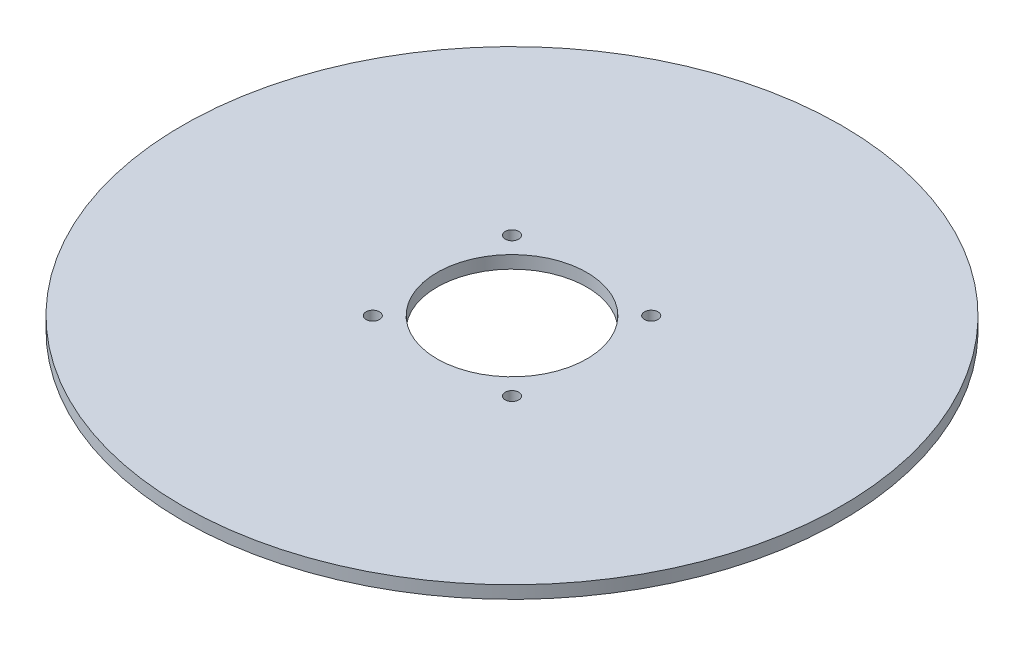
ISO-10303-21;
HEADER;
FILE_DESCRIPTION(('STEP AP214'),'2;1');
FILE_NAME('part.step','',(''),(''),'','','');
FILE_SCHEMA(('AUTOMOTIVE_DESIGN { 1 0 10303 214 1 1 1 1 }'));
ENDSEC;
DATA;
#1=APPLICATION_CONTEXT('core data for automotive mechanical design processes');
#2=APPLICATION_PROTOCOL_DEFINITION('international standard','automotive_design',2000,#1);
#3=PRODUCT_CONTEXT('',#1,'mechanical');
#4=PRODUCT('Part','Part','',(#3));
#5=PRODUCT_RELATED_PRODUCT_CATEGORY('part','',(#4));
#6=PRODUCT_DEFINITION_FORMATION('','',#4);
#7=PRODUCT_DEFINITION_CONTEXT('part definition',#1,'design');
#8=PRODUCT_DEFINITION('design','',#6,#7);
#9=PRODUCT_DEFINITION_SHAPE('','',#8);
#10=(LENGTH_UNIT() NAMED_UNIT(*) SI_UNIT(.MILLI.,.METRE.));
#11=(NAMED_UNIT(*) PLANE_ANGLE_UNIT() SI_UNIT($,.RADIAN.));
#12=(NAMED_UNIT(*) SI_UNIT($,.STERADIAN.) SOLID_ANGLE_UNIT());
#13=UNCERTAINTY_MEASURE_WITH_UNIT(LENGTH_MEASURE(1.E-05),#10,'distance_accuracy_value','');
#14=(GEOMETRIC_REPRESENTATION_CONTEXT(3) GLOBAL_UNCERTAINTY_ASSIGNED_CONTEXT((#13)) GLOBAL_UNIT_ASSIGNED_CONTEXT((#10,
#11,#12)) REPRESENTATION_CONTEXT('',''));
#15=CARTESIAN_POINT('',(0.,0.,0.));
#16=DIRECTION('',(0.,0.,1.));
#17=DIRECTION('',(1.,0.,0.));
#18=AXIS2_PLACEMENT_3D('',#15,#16,#17);
#19=CARTESIAN_POINT('',(0.,6.35,0.));
#20=DIRECTION('',(0.,-1.,0.));
#21=DIRECTION('',(0.,0.,-1.));
#22=AXIS2_PLACEMENT_3D('',#19,#20,#21);
#23=CYLINDRICAL_SURFACE('',#22,165.);
#24=CARTESIAN_POINT('',(0.,6.35,0.));
#25=DIRECTION('',(0.,1.,0.));
#26=DIRECTION('',(0.,0.,1.));
#27=AXIS2_PLACEMENT_3D('',#24,#25,#26);
#28=CIRCLE('',#27,165.);
#29=CARTESIAN_POINT('',(0.,6.35,165.));
#30=VERTEX_POINT('',#29);
#31=EDGE_CURVE('E10',#30,#30,#28,.T.);
#32=ORIENTED_EDGE('',*,*,#31,.F.);
#33=EDGE_LOOP('',(#32));
#34=FACE_BOUND('',#33,.T.);
#35=CARTESIAN_POINT('',(0.,0.,0.));
#36=DIRECTION('',(0.,1.,0.));
#37=DIRECTION('',(0.,0.,1.));
#38=AXIS2_PLACEMENT_3D('',#35,#36,#37);
#39=CIRCLE('',#38,165.);
#40=CARTESIAN_POINT('',(0.,0.,165.));
#41=VERTEX_POINT('',#40);
#42=EDGE_CURVE('E40',#41,#41,#39,.T.);
#43=ORIENTED_EDGE('',*,*,#42,.T.);
#44=EDGE_LOOP('',(#43));
#45=FACE_BOUND('',#44,.T.);
#46=ADVANCED_FACE('F37',(#34,#45),#23,.T.);
#47=CARTESIAN_POINT('',(0.,6.35,0.));
#48=DIRECTION('',(0.,1.,0.));
#49=DIRECTION('',(0.,0.,1.));
#50=AXIS2_PLACEMENT_3D('',#47,#48,#49);
#51=PLANE('',#50);
#52=CARTESIAN_POINT('',(0.,6.35,0.));
#53=DIRECTION('',(0.,1.,0.));
#54=DIRECTION('',(0.,0.,1.));
#55=AXIS2_PLACEMENT_3D('',#52,#53,#54);
#56=CIRCLE('',#55,37.5);
#57=CARTESIAN_POINT('',(0.,6.35,37.5));
#58=VERTEX_POINT('',#57);
#59=EDGE_CURVE('E83',#58,#58,#56,.T.);
#60=ORIENTED_EDGE('',*,*,#59,.F.);
#61=EDGE_LOOP('',(#60));
#62=FACE_BOUND('',#61,.T.);
#63=CARTESIAN_POINT('',(-34.85,6.35,-34.85));
#64=DIRECTION('',(0.,1.,0.));
#65=DIRECTION('',(0.,0.,1.));
#66=AXIS2_PLACEMENT_3D('',#63,#64,#65);
#67=CIRCLE('',#66,3.37819999999999);
#68=CARTESIAN_POINT('',(-34.85,6.35,-31.4718));
#69=VERTEX_POINT('',#68);
#70=EDGE_CURVE('E78',#69,#69,#67,.T.);
#71=ORIENTED_EDGE('',*,*,#70,.F.);
#72=EDGE_LOOP('',(#71));
#73=FACE_BOUND('',#72,.T.);
#74=CARTESIAN_POINT('',(34.85,6.35,34.85));
#75=DIRECTION('',(0.,1.,0.));
#76=DIRECTION('',(0.,0.,1.));
#77=AXIS2_PLACEMENT_3D('',#74,#75,#76);
#78=CIRCLE('',#77,3.37819999999999);
#79=CARTESIAN_POINT('',(34.85,6.35,38.2282));
#80=VERTEX_POINT('',#79);
#81=EDGE_CURVE('E70',#80,#80,#78,.T.);
#82=ORIENTED_EDGE('',*,*,#81,.F.);
#83=EDGE_LOOP('',(#82));
#84=FACE_BOUND('',#83,.T.);
#85=CARTESIAN_POINT('',(34.85,6.35,-34.85));
#86=DIRECTION('',(0.,1.,0.));
#87=DIRECTION('',(0.,0.,1.));
#88=AXIS2_PLACEMENT_3D('',#85,#86,#87);
#89=CIRCLE('',#88,3.37819999999999);
#90=CARTESIAN_POINT('',(34.85,6.35,-31.4718));
#91=VERTEX_POINT('',#90);
#92=EDGE_CURVE('E62',#91,#91,#89,.T.);
#93=ORIENTED_EDGE('',*,*,#92,.F.);
#94=EDGE_LOOP('',(#93));
#95=FACE_BOUND('',#94,.T.);
#96=CARTESIAN_POINT('',(-34.85,6.35,34.85));
#97=DIRECTION('',(0.,1.,0.));
#98=DIRECTION('',(0.,0.,1.));
#99=AXIS2_PLACEMENT_3D('',#96,#97,#98);
#100=CIRCLE('',#99,3.37819999999998);
#101=CARTESIAN_POINT('',(-34.85,6.35,38.2282));
#102=VERTEX_POINT('',#101);
#103=EDGE_CURVE('E54',#102,#102,#100,.T.);
#104=ORIENTED_EDGE('',*,*,#103,.F.);
#105=EDGE_LOOP('',(#104));
#106=FACE_BOUND('',#105,.T.);
#107=ORIENTED_EDGE('',*,*,#31,.T.);
#108=EDGE_LOOP('',(#107));
#109=FACE_BOUND('',#108,.T.);
#110=ADVANCED_FACE('F101',(#62,#73,#84,#95,#106,#109),#51,.T.);
#111=CARTESIAN_POINT('',(0.,0.,0.));
#112=DIRECTION('',(0.,1.,0.));
#113=DIRECTION('',(0.,0.,1.));
#114=AXIS2_PLACEMENT_3D('',#111,#112,#113);
#115=PLANE('',#114);
#116=CARTESIAN_POINT('',(0.,0.,0.));
#117=DIRECTION('',(0.,1.,0.));
#118=DIRECTION('',(0.,0.,1.));
#119=AXIS2_PLACEMENT_3D('',#116,#117,#118);
#120=CIRCLE('',#119,37.5);
#121=CARTESIAN_POINT('',(0.,0.,37.5));
#122=VERTEX_POINT('',#121);
#123=EDGE_CURVE('E82',#122,#122,#120,.T.);
#124=ORIENTED_EDGE('',*,*,#123,.T.);
#125=EDGE_LOOP('',(#124));
#126=FACE_BOUND('',#125,.T.);
#127=CARTESIAN_POINT('',(-34.85,0.,-34.85));
#128=DIRECTION('',(0.,1.,0.));
#129=DIRECTION('',(0.,0.,1.));
#130=AXIS2_PLACEMENT_3D('',#127,#128,#129);
#131=CIRCLE('',#130,3.3782);
#132=CARTESIAN_POINT('',(-34.85,0.,-31.4718));
#133=VERTEX_POINT('',#132);
#134=EDGE_CURVE('E74',#133,#133,#131,.T.);
#135=ORIENTED_EDGE('',*,*,#134,.T.);
#136=EDGE_LOOP('',(#135));
#137=FACE_BOUND('',#136,.T.);
#138=CARTESIAN_POINT('',(34.85,0.,34.85));
#139=DIRECTION('',(0.,1.,0.));
#140=DIRECTION('',(0.,0.,1.));
#141=AXIS2_PLACEMENT_3D('',#138,#139,#140);
#142=CIRCLE('',#141,3.3782);
#143=CARTESIAN_POINT('',(34.85,0.,38.2282));
#144=VERTEX_POINT('',#143);
#145=EDGE_CURVE('E66',#144,#144,#142,.T.);
#146=ORIENTED_EDGE('',*,*,#145,.T.);
#147=EDGE_LOOP('',(#146));
#148=FACE_BOUND('',#147,.T.);
#149=CARTESIAN_POINT('',(34.85,0.,-34.85));
#150=DIRECTION('',(0.,1.,0.));
#151=DIRECTION('',(0.,0.,1.));
#152=AXIS2_PLACEMENT_3D('',#149,#150,#151);
#153=CIRCLE('',#152,3.3782);
#154=CARTESIAN_POINT('',(34.85,0.,-31.4718));
#155=VERTEX_POINT('',#154);
#156=EDGE_CURVE('E58',#155,#155,#153,.T.);
#157=ORIENTED_EDGE('',*,*,#156,.T.);
#158=EDGE_LOOP('',(#157));
#159=FACE_BOUND('',#158,.T.);
#160=CARTESIAN_POINT('',(-34.85,0.,34.85));
#161=DIRECTION('',(0.,1.,0.));
#162=DIRECTION('',(0.,0.,1.));
#163=AXIS2_PLACEMENT_3D('',#160,#161,#162);
#164=CIRCLE('',#163,3.3782);
#165=CARTESIAN_POINT('',(-34.85,0.,38.2282));
#166=VERTEX_POINT('',#165);
#167=EDGE_CURVE('E49',#166,#166,#164,.T.);
#168=ORIENTED_EDGE('',*,*,#167,.T.);
#169=EDGE_LOOP('',(#168));
#170=FACE_BOUND('',#169,.T.);
#171=ORIENTED_EDGE('',*,*,#42,.F.);
#172=EDGE_LOOP('',(#171));
#173=FACE_BOUND('',#172,.T.);
#174=ADVANCED_FACE('F91',(#126,#137,#148,#159,#170,#173),#115,.F.);
#175=CARTESIAN_POINT('',(-34.85,6.35,34.85));
#176=DIRECTION('',(0.,1.,0.));
#177=DIRECTION('',(0.,0.,1.));
#178=AXIS2_PLACEMENT_3D('',#175,#176,#177);
#179=CYLINDRICAL_SURFACE('',#178,3.37819999999999);
#180=ORIENTED_EDGE('',*,*,#167,.F.);
#181=EDGE_LOOP('',(#180));
#182=FACE_BOUND('',#181,.T.);
#183=ORIENTED_EDGE('',*,*,#103,.T.);
#184=EDGE_LOOP('',(#183));
#185=FACE_BOUND('',#184,.T.);
#186=ADVANCED_FACE('F113',(#182,#185),#179,.F.);
#187=CARTESIAN_POINT('',(34.85,6.35,-34.85));
#188=DIRECTION('',(0.,1.,0.));
#189=DIRECTION('',(0.,0.,1.));
#190=AXIS2_PLACEMENT_3D('',#187,#188,#189);
#191=CYLINDRICAL_SURFACE('',#190,3.37819999999999);
#192=ORIENTED_EDGE('',*,*,#156,.F.);
#193=EDGE_LOOP('',(#192));
#194=FACE_BOUND('',#193,.T.);
#195=ORIENTED_EDGE('',*,*,#92,.T.);
#196=EDGE_LOOP('',(#195));
#197=FACE_BOUND('',#196,.T.);
#198=ADVANCED_FACE('F115',(#194,#197),#191,.F.);
#199=CARTESIAN_POINT('',(34.85,6.35,34.85));
#200=DIRECTION('',(0.,1.,0.));
#201=DIRECTION('',(0.,0.,1.));
#202=AXIS2_PLACEMENT_3D('',#199,#200,#201);
#203=CYLINDRICAL_SURFACE('',#202,3.37819999999999);
#204=ORIENTED_EDGE('',*,*,#145,.F.);
#205=EDGE_LOOP('',(#204));
#206=FACE_BOUND('',#205,.T.);
#207=ORIENTED_EDGE('',*,*,#81,.T.);
#208=EDGE_LOOP('',(#207));
#209=FACE_BOUND('',#208,.T.);
#210=ADVANCED_FACE('F122',(#206,#209),#203,.F.);
#211=CARTESIAN_POINT('',(-34.85,6.35,-34.85));
#212=DIRECTION('',(0.,1.,0.));
#213=DIRECTION('',(0.,0.,1.));
#214=AXIS2_PLACEMENT_3D('',#211,#212,#213);
#215=CYLINDRICAL_SURFACE('',#214,3.37819999999999);
#216=ORIENTED_EDGE('',*,*,#134,.F.);
#217=EDGE_LOOP('',(#216));
#218=FACE_BOUND('',#217,.T.);
#219=ORIENTED_EDGE('',*,*,#70,.T.);
#220=EDGE_LOOP('',(#219));
#221=FACE_BOUND('',#220,.T.);
#222=ADVANCED_FACE('F97',(#218,#221),#215,.F.);
#223=CARTESIAN_POINT('',(0.,0.,0.));
#224=DIRECTION('',(0.,1.,0.));
#225=DIRECTION('',(0.,0.,1.));
#226=AXIS2_PLACEMENT_3D('',#223,#224,#225);
#227=CYLINDRICAL_SURFACE('',#226,37.5);
#228=ORIENTED_EDGE('',*,*,#123,.F.);
#229=EDGE_LOOP('',(#228));
#230=FACE_BOUND('',#229,.T.);
#231=ORIENTED_EDGE('',*,*,#59,.T.);
#232=EDGE_LOOP('',(#231));
#233=FACE_BOUND('',#232,.T.);
#234=ADVANCED_FACE('F94',(#230,#233),#227,.F.);
#235=CLOSED_SHELL('',(#46,#110,#174,#186,#198,#210,#222,#234));
#236=MANIFOLD_SOLID_BREP('B2',#235);
#237=ADVANCED_BREP_SHAPE_REPRESENTATION('',(#18,#236),#14);
#238=SHAPE_DEFINITION_REPRESENTATION(#9,#237);
ENDSEC;
END-ISO-10303-21;
